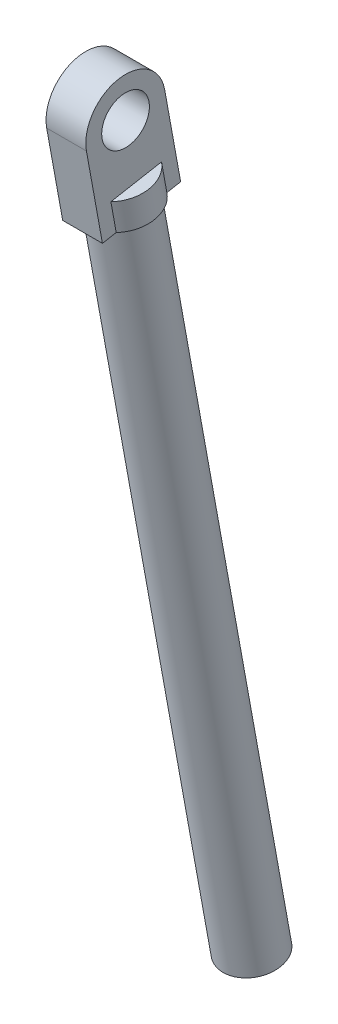
ISO-10303-21;
HEADER;
FILE_DESCRIPTION(('STEP AP214'),'2;1');
FILE_NAME('part.step','',(''),(''),'','','');
FILE_SCHEMA(('AUTOMOTIVE_DESIGN { 1 0 10303 214 1 1 1 1 }'));
ENDSEC;
DATA;
#1=APPLICATION_CONTEXT('core data for automotive mechanical design processes');
#2=APPLICATION_PROTOCOL_DEFINITION('international standard','automotive_design',2000,#1);
#3=PRODUCT_CONTEXT('',#1,'mechanical');
#4=PRODUCT('Part','Part','',(#3));
#5=PRODUCT_RELATED_PRODUCT_CATEGORY('part','',(#4));
#6=PRODUCT_DEFINITION_FORMATION('','',#4);
#7=PRODUCT_DEFINITION_CONTEXT('part definition',#1,'design');
#8=PRODUCT_DEFINITION('design','',#6,#7);
#9=PRODUCT_DEFINITION_SHAPE('','',#8);
#10=(LENGTH_UNIT() NAMED_UNIT(*) SI_UNIT(.MILLI.,.METRE.));
#11=(NAMED_UNIT(*) PLANE_ANGLE_UNIT() SI_UNIT($,.RADIAN.));
#12=(NAMED_UNIT(*) SI_UNIT($,.STERADIAN.) SOLID_ANGLE_UNIT());
#13=UNCERTAINTY_MEASURE_WITH_UNIT(LENGTH_MEASURE(1.E-05),#10,'distance_accuracy_value','');
#14=(GEOMETRIC_REPRESENTATION_CONTEXT(3) GLOBAL_UNCERTAINTY_ASSIGNED_CONTEXT((#13)) GLOBAL_UNIT_ASSIGNED_CONTEXT((#10,
#11,#12)) REPRESENTATION_CONTEXT('',''));
#15=CARTESIAN_POINT('',(0.,0.,0.));
#16=DIRECTION('',(0.,0.,1.));
#17=DIRECTION('',(1.,0.,0.));
#18=AXIS2_PLACEMENT_3D('',#15,#16,#17);
#19=CARTESIAN_POINT('',(1550.00000000001,1602.21552230462,443.812235803624));
#20=DIRECTION('',(0.,-0.983852787309741,-0.178979587950285));
#21=DIRECTION('',(-1.,0.,0.));
#22=AXIS2_PLACEMENT_3D('',#19,#20,#21);
#23=PLANE('',#22);
#24=DIRECTION('',(0.,0.178979587950285,-0.983852787309741));
#25=VECTOR('',#24,1.);
#26=CARTESIAN_POINT('',(1499.99999999996,1602.21552230462,443.812235803624));
#27=LINE('',#26,#25);
#28=CARTESIAN_POINT('',(1499.99999999996,1590.62765330564,507.51088068373));
#29=VERTEX_POINT('',#28);
#30=CARTESIAN_POINT('',(1499.99999999996,1613.80339130361,380.11359092352));
#31=VERTEX_POINT('',#30);
#32=EDGE_CURVE('E85',#29,#31,#27,.T.);
#33=ORIENTED_EDGE('',*,*,#32,.T.);
#34=CARTESIAN_POINT('',(1550.00000000001,1602.21552230462,443.812235803624));
#35=DIRECTION('',(0.,-0.983852787309741,-0.178979587950285));
#36=DIRECTION('',(-1.,0.,0.));
#37=AXIS2_PLACEMENT_3D('',#34,#35,#36);
#38=CIRCLE('',#37,81.8033988750117);
#39=EDGE_CURVE('E19',#29,#31,#38,.T.);
#40=ORIENTED_EDGE('',*,*,#39,.F.);
#41=EDGE_LOOP('',(#33,#40));
#42=FACE_BOUND('',#41,.T.);
#43=ADVANCED_FACE('F16',(#42),#23,.F.);
#44=CARTESIAN_POINT('',(1499.99999999996,1749.7934404011,470.659173996168));
#45=DIRECTION('',(-1.,0.,0.));
#46=DIRECTION('',(0.,0.983852787309741,0.178979587950285));
#47=AXIS2_PLACEMENT_3D('',#44,#45,#46);
#48=CYLINDRICAL_SURFACE('',#47,60.0000000000005);
#49=CARTESIAN_POINT('',(1599.99999999996,1749.7934404011,470.659173996168));
#50=DIRECTION('',(-1.,0.,0.));
#51=DIRECTION('',(0.,0.983852787309741,0.178979587950285));
#52=AXIS2_PLACEMENT_3D('',#49,#50,#51);
#53=CIRCLE('',#52,60.0000000000005);
#54=CARTESIAN_POINT('',(1599.99999999996,1808.82460763968,481.397949273185));
#55=VERTEX_POINT('',#54);
#56=EDGE_CURVE('E115',#55,#55,#53,.T.);
#57=ORIENTED_EDGE('',*,*,#56,.F.);
#58=EDGE_LOOP('',(#57));
#59=FACE_BOUND('',#58,.T.);
#60=CARTESIAN_POINT('',(1499.99999999996,1749.7934404011,470.659173996168));
#61=DIRECTION('',(-1.,0.,0.));
#62=DIRECTION('',(0.,0.983852787309741,0.178979587950285));
#63=AXIS2_PLACEMENT_3D('',#60,#61,#62);
#64=CIRCLE('',#63,60.0000000000005);
#65=CARTESIAN_POINT('',(1499.99999999996,1808.82460763968,481.397949273185));
#66=VERTEX_POINT('',#65);
#67=EDGE_CURVE('E83',#66,#66,#64,.T.);
#68=ORIENTED_EDGE('',*,*,#67,.T.);
#69=EDGE_LOOP('',(#68));
#70=FACE_BOUND('',#69,.T.);
#71=ADVANCED_FACE('F141',(#59,#70),#48,.F.);
#72=CARTESIAN_POINT('',(1499.99999999996,1749.7934404011,470.659173996168));
#73=DIRECTION('',(1.,0.,0.));
#74=DIRECTION('',(0.,-0.983852787309741,-0.178979587950285));
#75=AXIS2_PLACEMENT_3D('',#72,#73,#74);
#76=CYLINDRICAL_SURFACE('',#75,99.9999999999996);
#77=CARTESIAN_POINT('',(1499.99999999996,1749.7934404011,470.659173996168));
#78=DIRECTION('',(1.,0.,0.));
#79=DIRECTION('',(0.,-0.983852787309741,-0.178979587950285));
#80=AXIS2_PLACEMENT_3D('',#77,#78,#79);
#81=CIRCLE('',#80,99.9999999999996);
#82=CARTESIAN_POINT('',(1499.99999999996,1767.69139919613,372.273895265193));
#83=VERTEX_POINT('',#82);
#84=CARTESIAN_POINT('',(1499.99999999996,1731.89548160607,569.044452727142));
#85=VERTEX_POINT('',#84);
#86=EDGE_CURVE('E95',#83,#85,#81,.T.);
#87=ORIENTED_EDGE('',*,*,#86,.T.);
#88=DIRECTION('',(1.,0.,0.));
#89=VECTOR('',#88,1.);
#90=CARTESIAN_POINT('',(1499.99999999996,1731.89548160607,569.044452727142));
#91=LINE('',#90,#89);
#92=CARTESIAN_POINT('',(1599.99999999996,1731.89548160607,569.044452727142));
#93=VERTEX_POINT('',#92);
#94=EDGE_CURVE('E84',#93,#85,#91,.F.);
#95=ORIENTED_EDGE('',*,*,#94,.F.);
#96=CARTESIAN_POINT('',(1599.99999999996,1749.7934404011,470.659173996168));
#97=DIRECTION('',(1.,0.,0.));
#98=DIRECTION('',(0.,-0.983852787309741,-0.178979587950285));
#99=AXIS2_PLACEMENT_3D('',#96,#97,#98);
#100=CIRCLE('',#99,99.9999999999996);
#101=CARTESIAN_POINT('',(1599.99999999996,1767.69139919613,372.273895265193));
#102=VERTEX_POINT('',#101);
#103=EDGE_CURVE('E132',#102,#93,#100,.T.);
#104=ORIENTED_EDGE('',*,*,#103,.F.);
#105=DIRECTION('',(1.,0.,0.));
#106=VECTOR('',#105,1.);
#107=CARTESIAN_POINT('',(1499.99999999996,1767.69139919613,372.273895265193));
#108=LINE('',#107,#106);
#109=EDGE_CURVE('E118',#83,#102,#108,.T.);
#110=ORIENTED_EDGE('',*,*,#109,.F.);
#111=EDGE_LOOP('',(#87,#95,#104,#110));
#112=FACE_BOUND('',#111,.T.);
#113=ADVANCED_FACE('F144',(#112),#76,.T.);
#114=CARTESIAN_POINT('',(1550.00000000001,1602.21552230462,443.812235803624));
#115=DIRECTION('',(0.,-0.983852787309741,-0.178979587950285));
#116=DIRECTION('',(-1.,0.,0.));
#117=AXIS2_PLACEMENT_3D('',#114,#115,#116);
#118=PLANE('',#117);
#119=DIRECTION('',(0.,0.178979587950285,-0.983852787309741));
#120=VECTOR('',#119,1.);
#121=CARTESIAN_POINT('',(1599.99999999996,1602.21552230462,443.812235803624));
#122=LINE('',#121,#120);
#123=CARTESIAN_POINT('',(1599.99999999996,1590.62765330563,507.510880683802));
#124=VERTEX_POINT('',#123);
#125=CARTESIAN_POINT('',(1599.99999999996,1613.80339130362,380.113590923445));
#126=VERTEX_POINT('',#125);
#127=EDGE_CURVE('E112',#124,#126,#122,.T.);
#128=ORIENTED_EDGE('',*,*,#127,.F.);
#129=CARTESIAN_POINT('',(1550.00000000001,1602.21552230462,443.812235803624));
#130=DIRECTION('',(0.,-0.983852787309741,-0.178979587950285));
#131=DIRECTION('',(-1.,0.,0.));
#132=AXIS2_PLACEMENT_3D('',#129,#130,#131);
#133=CIRCLE('',#132,81.8033988750113);
#134=EDGE_CURVE('E128',#126,#124,#133,.T.);
#135=ORIENTED_EDGE('',*,*,#134,.F.);
#136=EDGE_LOOP('',(#128,#135));
#137=FACE_BOUND('',#136,.T.);
#138=ADVANCED_FACE('F230',(#137),#118,.F.);
#139=CARTESIAN_POINT('',(1499.99999999996,1731.89548160607,569.044452727142));
#140=DIRECTION('',(0.,-0.178979587950285,0.983852787309741));
#141=DIRECTION('',(0.,-0.983852787309741,-0.178979587950285));
#142=AXIS2_PLACEMENT_3D('',#139,#140,#141);
#143=PLANE('',#142);
#144=DIRECTION('',(0.,-0.983852787309741,-0.178979587950285));
#145=VECTOR('',#144,1.);
#146=CARTESIAN_POINT('',(1499.99999999996,1731.89548160607,569.044452727142));
#147=LINE('',#146,#145);
#148=CARTESIAN_POINT('',(1499.99999999996,1510.52860446137,528.774045438326));
#149=VERTEX_POINT('',#148);
#150=EDGE_CURVE('E97',#85,#149,#147,.T.);
#151=ORIENTED_EDGE('',*,*,#150,.T.);
#152=DIRECTION('',(-1.,0.,0.));
#153=VECTOR('',#152,1.);
#154=CARTESIAN_POINT('',(1499.99999999996,1510.52860446137,528.774045438326));
#155=LINE('',#154,#153);
#156=CARTESIAN_POINT('',(1599.99999999996,1510.52860446137,528.774045438326));
#157=VERTEX_POINT('',#156);
#158=EDGE_CURVE('E105',#157,#149,#155,.T.);
#159=ORIENTED_EDGE('',*,*,#158,.F.);
#160=DIRECTION('',(0.,-0.983852787309741,-0.178979587950285));
#161=VECTOR('',#160,1.);
#162=CARTESIAN_POINT('',(1599.99999999996,1731.89548160607,569.044452727142));
#163=LINE('',#162,#161);
#164=EDGE_CURVE('E135',#93,#157,#163,.T.);
#165=ORIENTED_EDGE('',*,*,#164,.F.);
#166=ORIENTED_EDGE('',*,*,#94,.T.);
#167=EDGE_LOOP('',(#151,#159,#165,#166));
#168=FACE_BOUND('',#167,.T.);
#169=ADVANCED_FACE('F156',(#168),#143,.T.);
#170=CARTESIAN_POINT('',(1550.00000000001,1602.21552230462,443.812235803624));
#171=DIRECTION('',(0.,-0.983852787309741,-0.178979587950285));
#172=DIRECTION('',(-1.,0.,0.));
#173=AXIS2_PLACEMENT_3D('',#170,#171,#172);
#174=CYLINDRICAL_SURFACE('',#173,81.8033988750117);
#175=DIRECTION('',(0.,-0.983852787309741,-0.178979587950285));
#176=VECTOR('',#175,1.);
#177=CARTESIAN_POINT('',(1499.99999999996,1761.38130940008,406.960529116065));
#178=LINE('',#177,#176);
#179=CARTESIAN_POINT('',(1499.99999999996,1540.01443225538,366.690121827248));
#180=VERTEX_POINT('',#179);
#181=EDGE_CURVE('E77',#31,#180,#178,.T.);
#182=ORIENTED_EDGE('',*,*,#181,.T.);
#183=CARTESIAN_POINT('',(1550.00000000001,1528.42656325639,430.388766707352));
#184=DIRECTION('',(0.,-0.983852787309741,-0.178979587950285));
#185=DIRECTION('',(-1.,0.,0.));
#186=AXIS2_PLACEMENT_3D('',#183,#184,#185);
#187=CIRCLE('',#186,81.8033988750117);
#188=CARTESIAN_POINT('',(1499.99999999996,1516.83869425741,494.087411587458));
#189=VERTEX_POINT('',#188);
#190=EDGE_CURVE('E126',#189,#180,#187,.T.);
#191=ORIENTED_EDGE('',*,*,#190,.F.);
#192=DIRECTION('',(0.,-0.983852787309741,-0.178979587950285));
#193=VECTOR('',#192,1.);
#194=CARTESIAN_POINT('',(1499.99999999996,1738.20557140211,534.357818876275));
#195=LINE('',#194,#193);
#196=EDGE_CURVE('E80',#189,#29,#195,.F.);
#197=ORIENTED_EDGE('',*,*,#196,.T.);
#198=ORIENTED_EDGE('',*,*,#39,.T.);
#199=EDGE_LOOP('',(#182,#191,#197,#198));
#200=FACE_BOUND('',#199,.T.);
#201=ADVANCED_FACE('F75',(#200),#174,.T.);
#202=CARTESIAN_POINT('',(1499.99999999996,1749.7934404011,470.659173996168));
#203=DIRECTION('',(1.,0.,0.));
#204=DIRECTION('',(0.,-0.983852787309741,-0.178979587950285));
#205=AXIS2_PLACEMENT_3D('',#202,#203,#204);
#206=PLANE('',#205);
#207=ORIENTED_EDGE('',*,*,#196,.F.);
#208=DIRECTION('',(0.,0.178979587950285,-0.983852787309741));
#209=VECTOR('',#208,1.);
#210=CARTESIAN_POINT('',(1499.99999999996,1510.52860446137,528.774045438326));
#211=LINE('',#210,#209);
#212=EDGE_CURVE('E108',#149,#189,#211,.T.);
#213=ORIENTED_EDGE('',*,*,#212,.F.);
#214=ORIENTED_EDGE('',*,*,#150,.F.);
#215=ORIENTED_EDGE('',*,*,#86,.F.);
#216=DIRECTION('',(0.,0.983852787309741,0.178979587950285));
#217=VECTOR('',#216,1.);
#218=CARTESIAN_POINT('',(1499.99999999996,1546.32452205142,332.003487976377));
#219=LINE('',#218,#217);
#220=CARTESIAN_POINT('',(1499.99999999996,1546.32452205142,332.003487976377));
#221=VERTEX_POINT('',#220);
#222=EDGE_CURVE('E87',#221,#83,#219,.T.);
#223=ORIENTED_EDGE('',*,*,#222,.F.);
#224=DIRECTION('',(0.,0.178979587950285,-0.983852787309741));
#225=VECTOR('',#224,1.);
#226=CARTESIAN_POINT('',(1499.99999999996,1510.52860446137,528.774045438326));
#227=LINE('',#226,#225);
#228=EDGE_CURVE('E93',#180,#221,#227,.T.);
#229=ORIENTED_EDGE('',*,*,#228,.F.);
#230=ORIENTED_EDGE('',*,*,#181,.F.);
#231=ORIENTED_EDGE('',*,*,#32,.F.);
#232=EDGE_LOOP('',(#207,#213,#214,#215,#223,#229,#230,#231));
#233=FACE_BOUND('',#232,.T.);
#234=ORIENTED_EDGE('',*,*,#67,.F.);
#235=EDGE_LOOP('',(#234));
#236=FACE_BOUND('',#235,.T.);
#237=ADVANCED_FACE('F89',(#233,#236),#206,.F.);
#238=CARTESIAN_POINT('',(1499.99999999996,1546.32452205142,332.003487976377));
#239=DIRECTION('',(0.,0.178979587950285,-0.983852787309741));
#240=DIRECTION('',(0.,0.983852787309741,0.178979587950285));
#241=AXIS2_PLACEMENT_3D('',#238,#239,#240);
#242=PLANE('',#241);
#243=ORIENTED_EDGE('',*,*,#222,.T.);
#244=ORIENTED_EDGE('',*,*,#109,.T.);
#245=DIRECTION('',(0.,-0.983852787309741,-0.178979587950285));
#246=VECTOR('',#245,1.);
#247=CARTESIAN_POINT('',(1599.99999999996,1767.69139919613,372.273895265193));
#248=LINE('',#247,#246);
#249=CARTESIAN_POINT('',(1599.99999999996,1546.32452205142,332.003487976377));
#250=VERTEX_POINT('',#249);
#251=EDGE_CURVE('E114',#250,#102,#248,.F.);
#252=ORIENTED_EDGE('',*,*,#251,.F.);
#253=DIRECTION('',(-1.,0.,0.));
#254=VECTOR('',#253,1.);
#255=CARTESIAN_POINT('',(1499.99999999996,1546.32452205142,332.003487976377));
#256=LINE('',#255,#254);
#257=EDGE_CURVE('E212',#221,#250,#256,.F.);
#258=ORIENTED_EDGE('',*,*,#257,.F.);
#259=EDGE_LOOP('',(#243,#244,#252,#258));
#260=FACE_BOUND('',#259,.T.);
#261=ADVANCED_FACE('F147',(#260),#242,.T.);
#262=CARTESIAN_POINT('',(1599.99999999996,1749.7934404011,470.659173996168));
#263=DIRECTION('',(1.,0.,0.));
#264=DIRECTION('',(0.,-0.983852787309741,-0.178979587950285));
#265=AXIS2_PLACEMENT_3D('',#262,#263,#264);
#266=PLANE('',#265);
#267=ORIENTED_EDGE('',*,*,#164,.T.);
#268=DIRECTION('',(0.,0.178979587950285,-0.983852787309741));
#269=VECTOR('',#268,1.);
#270=CARTESIAN_POINT('',(1599.99999999996,1510.52860446137,528.774045438326));
#271=LINE('',#270,#269);
#272=CARTESIAN_POINT('',(1599.99999999996,1516.83869425739,494.087411587531));
#273=VERTEX_POINT('',#272);
#274=EDGE_CURVE('E109',#273,#157,#271,.F.);
#275=ORIENTED_EDGE('',*,*,#274,.F.);
#276=DIRECTION('',(0.,-0.983852787309741,-0.178979587950285));
#277=VECTOR('',#276,1.);
#278=CARTESIAN_POINT('',(1599.99999999996,1590.62765330563,507.510880683802));
#279=LINE('',#278,#277);
#280=EDGE_CURVE('E131',#124,#273,#279,.T.);
#281=ORIENTED_EDGE('',*,*,#280,.F.);
#282=ORIENTED_EDGE('',*,*,#127,.T.);
#283=DIRECTION('',(0.,-0.983852787309741,-0.178979587950285));
#284=VECTOR('',#283,1.);
#285=CARTESIAN_POINT('',(1599.99999999996,1613.80339130362,380.113590923445));
#286=LINE('',#285,#284);
#287=CARTESIAN_POINT('',(1599.99999999996,1540.01443225539,366.690121827173));
#288=VERTEX_POINT('',#287);
#289=EDGE_CURVE('E34',#288,#126,#286,.F.);
#290=ORIENTED_EDGE('',*,*,#289,.F.);
#291=DIRECTION('',(0.,0.178979587950285,-0.983852787309741));
#292=VECTOR('',#291,1.);
#293=CARTESIAN_POINT('',(1599.99999999996,1510.52860446137,528.774045438326));
#294=LINE('',#293,#292);
#295=EDGE_CURVE('E125',#250,#288,#294,.F.);
#296=ORIENTED_EDGE('',*,*,#295,.F.);
#297=ORIENTED_EDGE('',*,*,#251,.T.);
#298=ORIENTED_EDGE('',*,*,#103,.T.);
#299=EDGE_LOOP('',(#267,#275,#281,#282,#290,#296,#297,#298));
#300=FACE_BOUND('',#299,.T.);
#301=ORIENTED_EDGE('',*,*,#56,.T.);
#302=EDGE_LOOP('',(#301));
#303=FACE_BOUND('',#302,.T.);
#304=ADVANCED_FACE('F139',(#300,#303),#266,.T.);
#305=CARTESIAN_POINT('',(1550.00000000001,1602.21552230462,443.812235803624));
#306=DIRECTION('',(0.,-0.983852787309741,-0.178979587950285));
#307=DIRECTION('',(-1.,0.,0.));
#308=AXIS2_PLACEMENT_3D('',#305,#306,#307);
#309=CYLINDRICAL_SURFACE('',#308,81.8033988750113);
#310=ORIENTED_EDGE('',*,*,#134,.T.);
#311=ORIENTED_EDGE('',*,*,#280,.T.);
#312=CARTESIAN_POINT('',(1550.00000000001,1528.42656325639,430.388766707352));
#313=DIRECTION('',(0.,-0.983852787309741,-0.178979587950285));
#314=DIRECTION('',(-1.,0.,0.));
#315=AXIS2_PLACEMENT_3D('',#312,#313,#314);
#316=CIRCLE('',#315,81.8033988750113);
#317=EDGE_CURVE('E122',#288,#273,#316,.T.);
#318=ORIENTED_EDGE('',*,*,#317,.F.);
#319=ORIENTED_EDGE('',*,*,#289,.T.);
#320=EDGE_LOOP('',(#310,#311,#318,#319));
#321=FACE_BOUND('',#320,.T.);
#322=ADVANCED_FACE('F173',(#321),#309,.T.);
#323=CARTESIAN_POINT('',(1622.50000000001,-267.104773583883,103.751018698081));
#324=DIRECTION('',(0.,-0.983852787309741,-0.178979587950285));
#325=DIRECTION('',(-1.,0.,0.));
#326=AXIS2_PLACEMENT_3D('',#323,#324,#325);
#327=PLANE('',#326);
#328=CARTESIAN_POINT('',(1550.00000000001,-267.104773583883,103.751018698081));
#329=DIRECTION('',(0.,0.983852787309741,0.178979587950285));
#330=DIRECTION('',(1.,0.,0.));
#331=AXIS2_PLACEMENT_3D('',#328,#329,#330);
#332=CIRCLE('',#331,72.5);
#333=CARTESIAN_POINT('',(1622.50000000001,-267.104773583883,103.751018698081));
#334=VERTEX_POINT('',#333);
#335=EDGE_CURVE('E25',#334,#334,#332,.T.);
#336=ORIENTED_EDGE('',*,*,#335,.F.);
#337=EDGE_LOOP('',(#336));
#338=FACE_BOUND('',#337,.T.);
#339=ADVANCED_FACE('F166',(#338),#327,.T.);
#340=CARTESIAN_POINT('',(1499.99999999996,1510.52860446137,528.774045438326));
#341=DIRECTION('',(0.,-0.983852787309741,-0.178979587950285));
#342=DIRECTION('',(-1.,0.,0.));
#343=AXIS2_PLACEMENT_3D('',#340,#341,#342);
#344=PLANE('',#343);
#345=ORIENTED_EDGE('',*,*,#295,.T.);
#346=ORIENTED_EDGE('',*,*,#317,.T.);
#347=ORIENTED_EDGE('',*,*,#274,.T.);
#348=ORIENTED_EDGE('',*,*,#158,.T.);
#349=ORIENTED_EDGE('',*,*,#212,.T.);
#350=ORIENTED_EDGE('',*,*,#190,.T.);
#351=ORIENTED_EDGE('',*,*,#228,.T.);
#352=ORIENTED_EDGE('',*,*,#257,.T.);
#353=EDGE_LOOP('',(#345,#346,#347,#348,#349,#350,#351,#352));
#354=FACE_BOUND('',#353,.T.);
#355=CARTESIAN_POINT('',(1550.00000000001,1528.42656325639,430.388766707352));
#356=DIRECTION('',(0.,0.983852787309741,0.178979587950285));
#357=DIRECTION('',(1.,0.,0.));
#358=AXIS2_PLACEMENT_3D('',#355,#356,#357);
#359=CIRCLE('',#358,72.5);
#360=CARTESIAN_POINT('',(1622.50000000001,1528.42656325639,430.388766707352));
#361=VERTEX_POINT('',#360);
#362=EDGE_CURVE('E10',#361,#361,#359,.F.);
#363=ORIENTED_EDGE('',*,*,#362,.F.);
#364=EDGE_LOOP('',(#363));
#365=FACE_BOUND('',#364,.T.);
#366=ADVANCED_FACE('F160',(#354,#365),#344,.T.);
#367=CARTESIAN_POINT('',(1550.00000000001,-267.104773583883,103.751018698081));
#368=DIRECTION('',(0.,0.983852787309741,0.178979587950285));
#369=DIRECTION('',(1.,0.,0.));
#370=AXIS2_PLACEMENT_3D('',#367,#368,#369);
#371=CYLINDRICAL_SURFACE('',#370,72.5);
#372=ORIENTED_EDGE('',*,*,#362,.T.);
#373=EDGE_LOOP('',(#372));
#374=FACE_BOUND('',#373,.T.);
#375=ORIENTED_EDGE('',*,*,#335,.T.);
#376=EDGE_LOOP('',(#375));
#377=FACE_BOUND('',#376,.T.);
#378=ADVANCED_FACE('F158',(#374,#377),#371,.T.);
#379=CLOSED_SHELL('',(#43,#71,#113,#138,#169,#201,#237,#261,#304,#322,#339,#366,#378));
#380=MANIFOLD_SOLID_BREP('B1',#379);
#381=ADVANCED_BREP_SHAPE_REPRESENTATION('',(#18,#380),#14);
#382=SHAPE_DEFINITION_REPRESENTATION(#9,#381);
ENDSEC;
END-ISO-10303-21;
